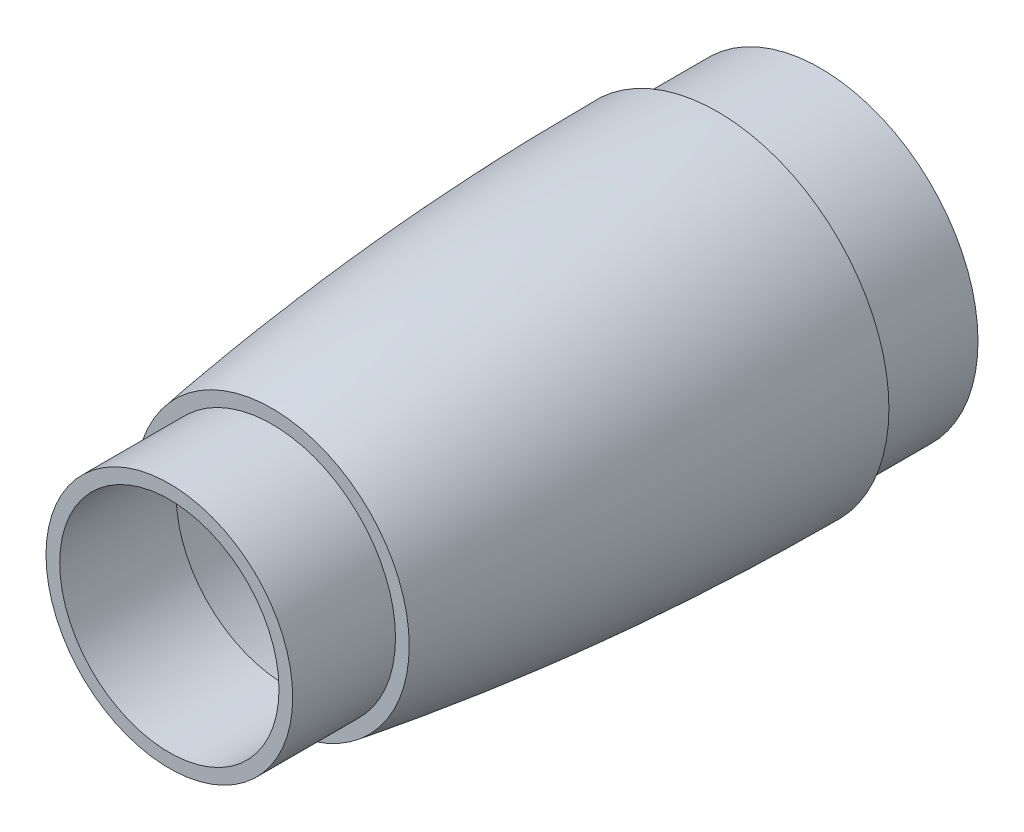
ISO-10303-21;
HEADER;
FILE_DESCRIPTION(('STEP AP214'),'2;1');
FILE_NAME('part.step','',(''),(''),'','','');
FILE_SCHEMA(('AUTOMOTIVE_DESIGN { 1 0 10303 214 1 1 1 1 }'));
ENDSEC;
DATA;
#1=APPLICATION_CONTEXT('core data for automotive mechanical design processes');
#2=APPLICATION_PROTOCOL_DEFINITION('international standard','automotive_design',2000,#1);
#3=PRODUCT_CONTEXT('',#1,'mechanical');
#4=PRODUCT('Part','Part','',(#3));
#5=PRODUCT_RELATED_PRODUCT_CATEGORY('part','',(#4));
#6=PRODUCT_DEFINITION_FORMATION('','',#4);
#7=PRODUCT_DEFINITION_CONTEXT('part definition',#1,'design');
#8=PRODUCT_DEFINITION('design','',#6,#7);
#9=PRODUCT_DEFINITION_SHAPE('','',#8);
#10=(LENGTH_UNIT() NAMED_UNIT(*) SI_UNIT(.MILLI.,.METRE.));
#11=(NAMED_UNIT(*) PLANE_ANGLE_UNIT() SI_UNIT($,.RADIAN.));
#12=(NAMED_UNIT(*) SI_UNIT($,.STERADIAN.) SOLID_ANGLE_UNIT());
#13=UNCERTAINTY_MEASURE_WITH_UNIT(LENGTH_MEASURE(1.E-05),#10,'distance_accuracy_value','');
#14=(GEOMETRIC_REPRESENTATION_CONTEXT(3) GLOBAL_UNCERTAINTY_ASSIGNED_CONTEXT((#13)) GLOBAL_UNIT_ASSIGNED_CONTEXT((#10,
#11,#12)) REPRESENTATION_CONTEXT('',''));
#15=CARTESIAN_POINT('',(0.,0.,0.));
#16=DIRECTION('',(0.,0.,1.));
#17=DIRECTION('',(1.,0.,0.));
#18=AXIS2_PLACEMENT_3D('',#15,#16,#17);
#19=CARTESIAN_POINT('',(0.,0.,0.));
#20=DIRECTION('',(0.,0.,1.));
#21=DIRECTION('',(1.,0.,0.));
#22=AXIS2_PLACEMENT_3D('',#19,#20,#21);
#23=CYLINDRICAL_SURFACE('',#22,23.);
#24=CARTESIAN_POINT('',(0.,0.,-79.9999998541825));
#25=DIRECTION('',(0.,0.,1.));
#26=DIRECTION('',(1.,0.,0.));
#27=AXIS2_PLACEMENT_3D('',#24,#25,#26);
#28=CIRCLE('',#27,23.);
#29=CARTESIAN_POINT('',(23.,0.,-79.9999998541825));
#30=VERTEX_POINT('',#29);
#31=EDGE_CURVE('E10',#30,#30,#28,.T.);
#32=ORIENTED_EDGE('',*,*,#31,.F.);
#33=EDGE_LOOP('',(#32));
#34=FACE_BOUND('',#33,.T.);
#35=CARTESIAN_POINT('',(0.,0.,-94.9999998541825));
#36=DIRECTION('',(0.,0.,1.));
#37=DIRECTION('',(1.,0.,0.));
#38=AXIS2_PLACEMENT_3D('',#35,#36,#37);
#39=CIRCLE('',#38,23.);
#40=CARTESIAN_POINT('',(23.,0.,-94.9999998541825));
#41=VERTEX_POINT('',#40);
#42=EDGE_CURVE('E88',#41,#41,#39,.T.);
#43=ORIENTED_EDGE('',*,*,#42,.T.);
#44=EDGE_LOOP('',(#43));
#45=FACE_BOUND('',#44,.T.);
#46=ADVANCED_FACE('F37',(#34,#45),#23,.T.);
#47=CARTESIAN_POINT('',(0.,25.,-79.9999998541825));
#48=DIRECTION('',(0.,0.,1.));
#49=DIRECTION('',(1.,0.,0.));
#50=AXIS2_PLACEMENT_3D('',#47,#48,#49);
#51=PLANE('',#50);
#52=CARTESIAN_POINT('',(0.,0.,-79.9999998541825));
#53=DIRECTION('',(0.,0.,1.));
#54=DIRECTION('',(1.,0.,0.));
#55=AXIS2_PLACEMENT_3D('',#52,#53,#54);
#56=CIRCLE('',#55,25.);
#57=CARTESIAN_POINT('',(25.,0.,-79.9999998541825));
#58=VERTEX_POINT('',#57);
#59=EDGE_CURVE('E44',#58,#58,#56,.T.);
#60=ORIENTED_EDGE('',*,*,#59,.F.);
#61=EDGE_LOOP('',(#60));
#62=FACE_BOUND('',#61,.T.);
#63=ORIENTED_EDGE('',*,*,#31,.T.);
#64=EDGE_LOOP('',(#63));
#65=FACE_BOUND('',#64,.T.);
#66=ADVANCED_FACE('F132',(#62,#65),#51,.F.);
#67=CARTESIAN_POINT('',(0.,25.,-79.9999998541821));
#68=CARTESIAN_POINT('',(0.,25.0000013184918,-73.499999854048));
#69=CARTESIAN_POINT('',(0.,24.8895438837211,-66.9999998571641));
#70=CARTESIAN_POINT('',(0.,24.6686287232455,-60.4999998635302));
#71=CARTESIAN_POINT('',(0.,24.337117594082,-53.9999998731502));
#72=CARTESIAN_POINT('',(0.,23.8947336995317,-47.4999998860324));
#73=CARTESIAN_POINT('',(0.,23.3410601857944,-40.9999999021891));
#74=CARTESIAN_POINT('',(0.,22.6755369270071,-34.4999999216368));
#75=CARTESIAN_POINT('',(0.,21.897455559535,-27.9999999443962));
#76=CARTESIAN_POINT('',(0.,21.0059525671727,-21.4999999704928));
#77=CARTESIAN_POINT('',(0.,19.9999999966466,-14.9999999999568));
#78=B_SPLINE_CURVE_WITH_KNOTS('',10,(#67,#68,#69,#70,#71,#72,#73,#74,#75,#76,#77),.UNSPECIFIED.,
.F.,.F.,(11,11),(0.0826096081064214,0.916600873459725),.UNSPECIFIED.);
#79=CARTESIAN_POINT('',(0.,0.,0.));
#80=DIRECTION('',(0.,0.,1.));
#81=AXIS1_PLACEMENT('',#79,#80);
#82=SURFACE_OF_REVOLUTION('',#78,#81);
#83=CARTESIAN_POINT('',(0.,0.,-14.9999999999568));
#84=DIRECTION('',(0.,0.,1.));
#85=DIRECTION('',(1.,0.,0.));
#86=AXIS2_PLACEMENT_3D('',#83,#84,#85);
#87=CIRCLE('',#86,19.9999999966466);
#88=CARTESIAN_POINT('',(19.9999999966466,0.,-14.9999999999568));
#89=VERTEX_POINT('',#88);
#90=EDGE_CURVE('E49',#89,#89,#87,.T.);
#91=ORIENTED_EDGE('',*,*,#90,.F.);
#92=EDGE_LOOP('',(#91));
#93=FACE_BOUND('',#92,.T.);
#94=ORIENTED_EDGE('',*,*,#59,.T.);
#95=EDGE_LOOP('',(#94));
#96=FACE_BOUND('',#95,.T.);
#97=ADVANCED_FACE('F129',(#93,#96),#82,.T.);
#98=CARTESIAN_POINT('',(0.,19.9999999966533,-14.9999999999784));
#99=DIRECTION('',(0.,0.,-1.));
#100=DIRECTION('',(-1.,0.,0.));
#101=AXIS2_PLACEMENT_3D('',#98,#99,#100);
#102=PLANE('',#101);
#103=CARTESIAN_POINT('',(0.,0.,-15.));
#104=DIRECTION('',(0.,0.,1.));
#105=DIRECTION('',(1.,0.,0.));
#106=AXIS2_PLACEMENT_3D('',#103,#104,#105);
#107=CIRCLE('',#106,17.9999999966533);
#108=CARTESIAN_POINT('',(17.9999999966533,0.,-15.));
#109=VERTEX_POINT('',#108);
#110=EDGE_CURVE('E54',#109,#109,#107,.T.);
#111=ORIENTED_EDGE('',*,*,#110,.F.);
#112=EDGE_LOOP('',(#111));
#113=FACE_BOUND('',#112,.T.);
#114=ORIENTED_EDGE('',*,*,#90,.T.);
#115=EDGE_LOOP('',(#114));
#116=FACE_BOUND('',#115,.T.);
#117=ADVANCED_FACE('F125',(#113,#116),#102,.F.);
#118=CARTESIAN_POINT('',(0.,0.,0.));
#119=DIRECTION('',(0.,0.,1.));
#120=DIRECTION('',(1.,0.,0.));
#121=AXIS2_PLACEMENT_3D('',#118,#119,#120);
#122=CYLINDRICAL_SURFACE('',#121,17.9999999966533);
#123=CARTESIAN_POINT('',(0.,0.,0.));
#124=DIRECTION('',(0.,0.,1.));
#125=DIRECTION('',(1.,0.,0.));
#126=AXIS2_PLACEMENT_3D('',#123,#124,#125);
#127=CIRCLE('',#126,17.9999999966533);
#128=CARTESIAN_POINT('',(17.9999999966533,0.,0.));
#129=VERTEX_POINT('',#128);
#130=EDGE_CURVE('E60',#129,#129,#127,.T.);
#131=ORIENTED_EDGE('',*,*,#130,.F.);
#132=EDGE_LOOP('',(#131));
#133=FACE_BOUND('',#132,.T.);
#134=ORIENTED_EDGE('',*,*,#110,.T.);
#135=EDGE_LOOP('',(#134));
#136=FACE_BOUND('',#135,.T.);
#137=ADVANCED_FACE('F121',(#133,#136),#122,.T.);
#138=CARTESIAN_POINT('',(0.,15.9999999966533,0.));
#139=DIRECTION('',(0.,0.,-1.));
#140=DIRECTION('',(-1.,0.,0.));
#141=AXIS2_PLACEMENT_3D('',#138,#139,#140);
#142=PLANE('',#141);
#143=CARTESIAN_POINT('',(0.,0.,0.));
#144=DIRECTION('',(0.,0.,1.));
#145=DIRECTION('',(1.,0.,0.));
#146=AXIS2_PLACEMENT_3D('',#143,#144,#145);
#147=CIRCLE('',#146,15.9999999966533);
#148=CARTESIAN_POINT('',(15.9999999966533,0.,0.));
#149=VERTEX_POINT('',#148);
#150=EDGE_CURVE('E64',#149,#149,#147,.T.);
#151=ORIENTED_EDGE('',*,*,#150,.F.);
#152=EDGE_LOOP('',(#151));
#153=FACE_BOUND('',#152,.T.);
#154=ORIENTED_EDGE('',*,*,#130,.T.);
#155=EDGE_LOOP('',(#154));
#156=FACE_BOUND('',#155,.T.);
#157=ADVANCED_FACE('F117',(#153,#156),#142,.F.);
#158=CARTESIAN_POINT('',(0.,0.,0.));
#159=DIRECTION('',(0.,0.,1.));
#160=DIRECTION('',(1.,0.,0.));
#161=AXIS2_PLACEMENT_3D('',#158,#159,#160);
#162=CYLINDRICAL_SURFACE('',#161,15.9999999966533);
#163=CARTESIAN_POINT('',(0.,0.,-17.));
#164=DIRECTION('',(0.,0.,1.));
#165=DIRECTION('',(1.,0.,0.));
#166=AXIS2_PLACEMENT_3D('',#163,#164,#165);
#167=CIRCLE('',#166,15.9999999966533);
#168=CARTESIAN_POINT('',(15.9999999966533,0.,-17.));
#169=VERTEX_POINT('',#168);
#170=EDGE_CURVE('E68',#169,#169,#167,.T.);
#171=ORIENTED_EDGE('',*,*,#170,.F.);
#172=EDGE_LOOP('',(#171));
#173=FACE_BOUND('',#172,.T.);
#174=ORIENTED_EDGE('',*,*,#150,.T.);
#175=EDGE_LOOP('',(#174));
#176=FACE_BOUND('',#175,.T.);
#177=ADVANCED_FACE('F113',(#173,#176),#162,.F.);
#178=CARTESIAN_POINT('',(0.,18.2822014378135,-17.));
#179=DIRECTION('',(0.,0.,1.));
#180=DIRECTION('',(1.,0.,0.));
#181=AXIS2_PLACEMENT_3D('',#178,#179,#180);
#182=PLANE('',#181);
#183=CARTESIAN_POINT('',(0.,0.,-17.));
#184=DIRECTION('',(0.,0.,1.));
#185=DIRECTION('',(1.,0.,0.));
#186=AXIS2_PLACEMENT_3D('',#183,#184,#185);
#187=CIRCLE('',#186,18.2822014378135);
#188=CARTESIAN_POINT('',(18.2822014378135,0.,-17.));
#189=VERTEX_POINT('',#188);
#190=EDGE_CURVE('E72',#189,#189,#187,.T.);
#191=ORIENTED_EDGE('',*,*,#190,.F.);
#192=EDGE_LOOP('',(#191));
#193=FACE_BOUND('',#192,.T.);
#194=ORIENTED_EDGE('',*,*,#170,.T.);
#195=EDGE_LOOP('',(#194));
#196=FACE_BOUND('',#195,.T.);
#197=ADVANCED_FACE('F108',(#193,#196),#182,.F.);
#198=CARTESIAN_POINT('',(0.,18.2822014378135,-17.));
#199=CARTESIAN_POINT('',(0.,19.0458679050677,-22.0702861524668));
#200=CARTESIAN_POINT('',(0.,20.3905418942208,-32.2561026561686));
#201=CARTESIAN_POINT('',(0.,21.8418026267596,-47.4982116539475));
#202=CARTESIAN_POINT('',(0.,22.740030273354,-62.7510511605634));
#203=CARTESIAN_POINT('',(0.,22.9712320920161,-72.9154065471183));
#204=CARTESIAN_POINT('',(0.,22.9952721990818,-77.9999998541826));
#205=B_SPLINE_CURVE_WITH_KNOTS('',3,(#198,#199,#200,#201,#202,#203,#204),.UNSPECIFIED.,.F.,.F.,
(4,1,1,1,4),(0.104448985933153,0.301041308917772,0.49763363190239,0.694225954887008,
0.890818277871627),.UNSPECIFIED.);
#206=CARTESIAN_POINT('',(0.,0.,0.));
#207=DIRECTION('',(0.,0.,1.));
#208=AXIS1_PLACEMENT('',#206,#207);
#209=SURFACE_OF_REVOLUTION('',#205,#208);
#210=CARTESIAN_POINT('',(0.,0.,-77.9999998541826));
#211=DIRECTION('',(0.,0.,1.));
#212=DIRECTION('',(1.,0.,0.));
#213=AXIS2_PLACEMENT_3D('',#210,#211,#212);
#214=CIRCLE('',#213,22.9952721990818);
#215=CARTESIAN_POINT('',(22.9952721990818,0.,-77.9999998541826));
#216=VERTEX_POINT('',#215);
#217=EDGE_CURVE('E76',#216,#216,#214,.T.);
#218=ORIENTED_EDGE('',*,*,#217,.F.);
#219=EDGE_LOOP('',(#218));
#220=FACE_BOUND('',#219,.T.);
#221=ORIENTED_EDGE('',*,*,#190,.T.);
#222=EDGE_LOOP('',(#221));
#223=FACE_BOUND('',#222,.T.);
#224=ADVANCED_FACE('F103',(#220,#223),#209,.T.);
#225=CARTESIAN_POINT('',(0.,22.9952721990818,-77.9999998541826));
#226=DIRECTION('',(0.,0.,-1.));
#227=DIRECTION('',(-1.,0.,0.));
#228=AXIS2_PLACEMENT_3D('',#225,#226,#227);
#229=PLANE('',#228);
#230=CARTESIAN_POINT('',(0.,0.,-77.9999998541825));
#231=DIRECTION('',(0.,0.,1.));
#232=DIRECTION('',(1.,0.,0.));
#233=AXIS2_PLACEMENT_3D('',#230,#231,#232);
#234=CIRCLE('',#233,21.);
#235=CARTESIAN_POINT('',(21.,0.,-77.9999998541825));
#236=VERTEX_POINT('',#235);
#237=EDGE_CURVE('E80',#236,#236,#234,.T.);
#238=ORIENTED_EDGE('',*,*,#237,.F.);
#239=EDGE_LOOP('',(#238));
#240=FACE_BOUND('',#239,.T.);
#241=ORIENTED_EDGE('',*,*,#217,.T.);
#242=EDGE_LOOP('',(#241));
#243=FACE_BOUND('',#242,.T.);
#244=ADVANCED_FACE('F107',(#240,#243),#229,.F.);
#245=CARTESIAN_POINT('',(0.,0.,0.));
#246=DIRECTION('',(0.,0.,1.));
#247=DIRECTION('',(1.,0.,0.));
#248=AXIS2_PLACEMENT_3D('',#245,#246,#247);
#249=CYLINDRICAL_SURFACE('',#248,21.);
#250=CARTESIAN_POINT('',(0.,0.,-94.9999998541825));
#251=DIRECTION('',(0.,0.,1.));
#252=DIRECTION('',(1.,0.,0.));
#253=AXIS2_PLACEMENT_3D('',#250,#251,#252);
#254=CIRCLE('',#253,21.);
#255=CARTESIAN_POINT('',(21.,0.,-94.9999998541825));
#256=VERTEX_POINT('',#255);
#257=EDGE_CURVE('E84',#256,#256,#254,.T.);
#258=ORIENTED_EDGE('',*,*,#257,.F.);
#259=EDGE_LOOP('',(#258));
#260=FACE_BOUND('',#259,.T.);
#261=ORIENTED_EDGE('',*,*,#237,.T.);
#262=EDGE_LOOP('',(#261));
#263=FACE_BOUND('',#262,.T.);
#264=ADVANCED_FACE('F148',(#260,#263),#249,.F.);
#265=CARTESIAN_POINT('',(0.,21.,-94.9999998541825));
#266=DIRECTION('',(0.,0.,1.));
#267=DIRECTION('',(1.,0.,0.));
#268=AXIS2_PLACEMENT_3D('',#265,#266,#267);
#269=PLANE('',#268);
#270=ORIENTED_EDGE('',*,*,#42,.F.);
#271=EDGE_LOOP('',(#270));
#272=FACE_BOUND('',#271,.T.);
#273=ORIENTED_EDGE('',*,*,#257,.T.);
#274=EDGE_LOOP('',(#273));
#275=FACE_BOUND('',#274,.T.);
#276=ADVANCED_FACE('F145',(#272,#275),#269,.F.);
#277=CLOSED_SHELL('',(#46,#66,#97,#117,#137,#157,#177,#197,#224,#244,#264,#276));
#278=MANIFOLD_SOLID_BREP('B2',#277);
#279=ADVANCED_BREP_SHAPE_REPRESENTATION('',(#18,#278),#14);
#280=SHAPE_DEFINITION_REPRESENTATION(#9,#279);
ENDSEC;
END-ISO-10303-21;
